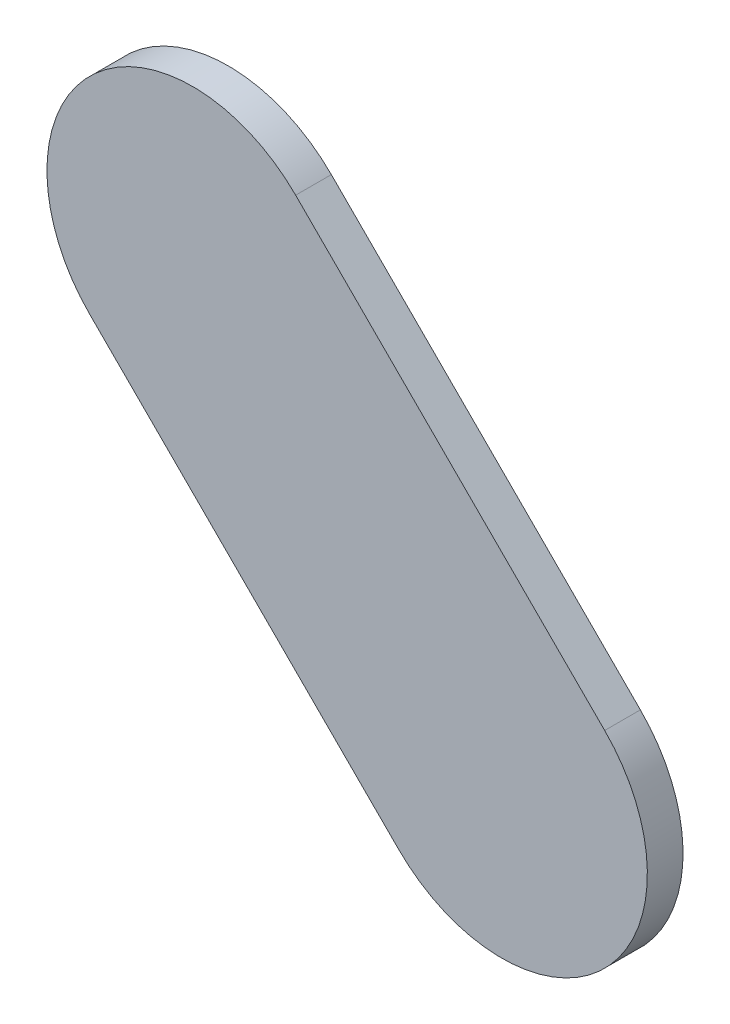
ISO-10303-21;
HEADER;
FILE_DESCRIPTION(('STEP AP214'),'2;1');
FILE_NAME('part.step','',(''),(''),'','','');
FILE_SCHEMA(('AUTOMOTIVE_DESIGN { 1 0 10303 214 1 1 1 1 }'));
ENDSEC;
DATA;
#1=APPLICATION_CONTEXT('core data for automotive mechanical design processes');
#2=APPLICATION_PROTOCOL_DEFINITION('international standard','automotive_design',2000,#1);
#3=PRODUCT_CONTEXT('',#1,'mechanical');
#4=PRODUCT('Part','Part','',(#3));
#5=PRODUCT_RELATED_PRODUCT_CATEGORY('part','',(#4));
#6=PRODUCT_DEFINITION_FORMATION('','',#4);
#7=PRODUCT_DEFINITION_CONTEXT('part definition',#1,'design');
#8=PRODUCT_DEFINITION('design','',#6,#7);
#9=PRODUCT_DEFINITION_SHAPE('','',#8);
#10=(LENGTH_UNIT() NAMED_UNIT(*) SI_UNIT(.MILLI.,.METRE.));
#11=(NAMED_UNIT(*) PLANE_ANGLE_UNIT() SI_UNIT($,.RADIAN.));
#12=(NAMED_UNIT(*) SI_UNIT($,.STERADIAN.) SOLID_ANGLE_UNIT());
#13=UNCERTAINTY_MEASURE_WITH_UNIT(LENGTH_MEASURE(1.E-05),#10,'distance_accuracy_value','');
#14=(GEOMETRIC_REPRESENTATION_CONTEXT(3) GLOBAL_UNCERTAINTY_ASSIGNED_CONTEXT((#13)) GLOBAL_UNIT_ASSIGNED_CONTEXT((#10,
#11,#12)) REPRESENTATION_CONTEXT('',''));
#15=CARTESIAN_POINT('',(0.,0.,0.));
#16=DIRECTION('',(0.,0.,1.));
#17=DIRECTION('',(1.,0.,0.));
#18=AXIS2_PLACEMENT_3D('',#15,#16,#17);
#19=CARTESIAN_POINT('',(4.786588999684,8.032144704874,0.79916));
#20=DIRECTION('',(0.,0.,1.));
#21=DIRECTION('',(1.,0.,0.));
#22=AXIS2_PLACEMENT_3D('',#19,#20,#21);
#23=PLANE('',#22);
#24=CARTESIAN_POINT('',(4.638203,8.180011101268,0.79916));
#25=DIRECTION('',(0.,0.,1.));
#26=DIRECTION('',(1.,0.,0.));
#27=AXIS2_PLACEMENT_3D('',#24,#25,#26);
#28=CIRCLE('',#27,0.140000470934);
#29=CARTESIAN_POINT('',(4.53920788900021,8.08101611099983,0.79916));
#30=VERTEX_POINT('',#29);
#31=CARTESIAN_POINT('',(4.73719836318403,8.2790063028169,0.79916));
#32=VERTEX_POINT('',#31);
#33=EDGE_CURVE('E20',#30,#32,#28,.F.);
#34=ORIENTED_EDGE('',*,*,#33,.F.);
#35=DIRECTION('',(-0.707107574045603,0.707105988326603,0.));
#36=VECTOR('',#35,1.);
#37=CARTESIAN_POINT('',(4.836193000001,7.784031666001,0.79916));
#38=LINE('',#37,#36);
#39=CARTESIAN_POINT('',(4.83619308081826,7.78403158518393,0.79916));
#40=VERTEX_POINT('',#39);
#41=EDGE_CURVE('E65',#30,#40,#38,.F.);
#42=ORIENTED_EDGE('',*,*,#41,.T.);
#43=CARTESIAN_POINT('',(4.935188,7.883026,0.79916));
#44=DIRECTION('',(0.,0.,1.));
#45=DIRECTION('',(1.,0.,0.));
#46=AXIS2_PLACEMENT_3D('',#43,#44,#45);
#47=CIRCLE('',#46,0.140000071608);
#48=CARTESIAN_POINT('',(5.0341828889999,7.98202111099958,0.79916));
#49=VERTEX_POINT('',#48);
#50=EDGE_CURVE('E57',#49,#40,#47,.F.);
#51=ORIENTED_EDGE('',*,*,#50,.F.);
#52=DIRECTION('',(0.707105988327103,-0.707107574045103,0.));
#53=VECTOR('',#52,1.);
#54=CARTESIAN_POINT('',(4.737198333001,8.279006333,0.79916));
#55=LINE('',#54,#53);
#56=EDGE_CURVE('E64',#49,#32,#55,.F.);
#57=ORIENTED_EDGE('',*,*,#56,.T.);
#58=EDGE_LOOP('',(#34,#42,#51,#57));
#59=FACE_BOUND('',#58,.T.);
#60=ADVANCED_FACE('F17',(#59),#23,.T.);
#61=CARTESIAN_POINT('',(4.836193000001,7.784031666001,0.76487));
#62=DIRECTION('',(0.707105988326603,0.707107574045603,0.));
#63=DIRECTION('',(-0.707107574045603,0.707105988326603,0.));
#64=AXIS2_PLACEMENT_3D('',#61,#62,#63);
#65=PLANE('',#64);
#66=DIRECTION('',(0.,0.,1.));
#67=VECTOR('',#66,1.);
#68=CARTESIAN_POINT('',(4.53920799999994,8.08101599999994,0.76487));
#69=LINE('',#68,#67);
#70=CARTESIAN_POINT('',(4.53920788900009,8.08101611099963,0.76487));
#71=VERTEX_POINT('',#70);
#72=EDGE_CURVE('E68',#71,#30,#69,.T.);
#73=ORIENTED_EDGE('',*,*,#72,.F.);
#74=DIRECTION('',(-0.70710757404611,0.707105988326096,0.));
#75=VECTOR('',#74,1.);
#76=CARTESIAN_POINT('',(4.836193000001,7.784031666001,0.76487));
#77=LINE('',#76,#75);
#78=CARTESIAN_POINT('',(4.83619308081829,7.78403158518389,0.76487));
#79=VERTEX_POINT('',#78);
#80=EDGE_CURVE('E72',#79,#71,#77,.T.);
#81=ORIENTED_EDGE('',*,*,#80,.F.);
#82=DIRECTION('',(0.,0.,1.));
#83=VECTOR('',#82,1.);
#84=CARTESIAN_POINT('',(4.836193000001,7.784031666001,0.76487));
#85=LINE('',#84,#83);
#86=EDGE_CURVE('E60',#40,#79,#85,.F.);
#87=ORIENTED_EDGE('',*,*,#86,.F.);
#88=ORIENTED_EDGE('',*,*,#41,.F.);
#89=EDGE_LOOP('',(#73,#81,#87,#88));
#90=FACE_BOUND('',#89,.T.);
#91=ADVANCED_FACE('F70',(#90),#65,.F.);
#92=CARTESIAN_POINT('',(4.638203,8.180011101268,0.76487));
#93=DIRECTION('',(0.,0.,1.));
#94=DIRECTION('',(1.,0.,0.));
#95=AXIS2_PLACEMENT_3D('',#92,#93,#94);
#96=CYLINDRICAL_SURFACE('',#95,0.140000470934);
#97=DIRECTION('',(0.,0.,1.));
#98=VECTOR('',#97,1.);
#99=CARTESIAN_POINT('',(4.737198333001,8.279006333,0.76487));
#100=LINE('',#99,#98);
#101=CARTESIAN_POINT('',(4.73719836318402,8.27900630281691,0.76487));
#102=VERTEX_POINT('',#101);
#103=EDGE_CURVE('E77',#32,#102,#100,.F.);
#104=ORIENTED_EDGE('',*,*,#103,.T.);
#105=CARTESIAN_POINT('',(4.638202667,8.180011333,0.76487));
#106=DIRECTION('',(0.,0.,1.));
#107=DIRECTION('',(1.,0.,0.));
#108=AXIS2_PLACEMENT_3D('',#105,#106,#107);
#109=CIRCLE('',#108,0.140000071608);
#110=EDGE_CURVE('E26',#71,#102,#109,.F.);
#111=ORIENTED_EDGE('',*,*,#110,.F.);
#112=ORIENTED_EDGE('',*,*,#72,.T.);
#113=ORIENTED_EDGE('',*,*,#33,.T.);
#114=EDGE_LOOP('',(#104,#111,#112,#113));
#115=FACE_BOUND('',#114,.T.);
#116=ADVANCED_FACE('F88',(#115),#96,.T.);
#117=CARTESIAN_POINT('',(4.737198333001,8.279006333,0.76487));
#118=DIRECTION('',(-0.707107574045103,-0.707105988327103,0.));
#119=DIRECTION('',(0.707105988327103,-0.707107574045103,0.));
#120=AXIS2_PLACEMENT_3D('',#117,#118,#119);
#121=PLANE('',#120);
#122=DIRECTION('',(0.,0.,1.));
#123=VECTOR('',#122,1.);
#124=CARTESIAN_POINT('',(5.03418266700006,7.98202133300006,0.76487));
#125=LINE('',#124,#123);
#126=CARTESIAN_POINT('',(5.03418288899993,7.98202111099964,0.76487));
#127=VERTEX_POINT('',#126);
#128=EDGE_CURVE('E62',#127,#49,#125,.T.);
#129=ORIENTED_EDGE('',*,*,#128,.F.);
#130=DIRECTION('',(0.707105988327285,-0.707107574044921,0.));
#131=VECTOR('',#130,1.);
#132=CARTESIAN_POINT('',(4.737198333001,8.279006333,0.76487));
#133=LINE('',#132,#131);
#134=EDGE_CURVE('E11',#102,#127,#133,.T.);
#135=ORIENTED_EDGE('',*,*,#134,.F.);
#136=ORIENTED_EDGE('',*,*,#103,.F.);
#137=ORIENTED_EDGE('',*,*,#56,.F.);
#138=EDGE_LOOP('',(#129,#135,#136,#137));
#139=FACE_BOUND('',#138,.T.);
#140=ADVANCED_FACE('F96',(#139),#121,.F.);
#141=CARTESIAN_POINT('',(4.935188,7.883026,0.76487));
#142=DIRECTION('',(0.,0.,1.));
#143=DIRECTION('',(1.,0.,0.));
#144=AXIS2_PLACEMENT_3D('',#141,#142,#143);
#145=CYLINDRICAL_SURFACE('',#144,0.140000071608);
#146=CARTESIAN_POINT('',(4.935188000001,7.883026564733,0.76487));
#147=DIRECTION('',(0.,0.,1.));
#148=DIRECTION('',(1.,0.,0.));
#149=AXIS2_PLACEMENT_3D('',#146,#147,#148);
#150=CIRCLE('',#149,0.14);
#151=EDGE_CURVE('E35',#127,#79,#150,.F.);
#152=ORIENTED_EDGE('',*,*,#151,.F.);
#153=ORIENTED_EDGE('',*,*,#128,.T.);
#154=ORIENTED_EDGE('',*,*,#50,.T.);
#155=ORIENTED_EDGE('',*,*,#86,.T.);
#156=EDGE_LOOP('',(#152,#153,#154,#155));
#157=FACE_BOUND('',#156,.T.);
#158=ADVANCED_FACE('F58',(#157),#145,.T.);
#159=CARTESIAN_POINT('',(4.786588999684,8.032144704874,0.76487));
#160=DIRECTION('',(0.,0.,-1.));
#161=DIRECTION('',(-1.,0.,0.));
#162=AXIS2_PLACEMENT_3D('',#159,#160,#161);
#163=PLANE('',#162);
#164=ORIENTED_EDGE('',*,*,#134,.T.);
#165=ORIENTED_EDGE('',*,*,#151,.T.);
#166=ORIENTED_EDGE('',*,*,#80,.T.);
#167=ORIENTED_EDGE('',*,*,#110,.T.);
#168=EDGE_LOOP('',(#164,#165,#166,#167));
#169=FACE_BOUND('',#168,.T.);
#170=ADVANCED_FACE('F89',(#169),#163,.T.);
#171=CLOSED_SHELL('',(#60,#91,#116,#140,#158,#170));
#172=MANIFOLD_SOLID_BREP('B1',#171);
#173=ADVANCED_BREP_SHAPE_REPRESENTATION('',(#18,#172),#14);
#174=SHAPE_DEFINITION_REPRESENTATION(#9,#173);
ENDSEC;
END-ISO-10303-21;
